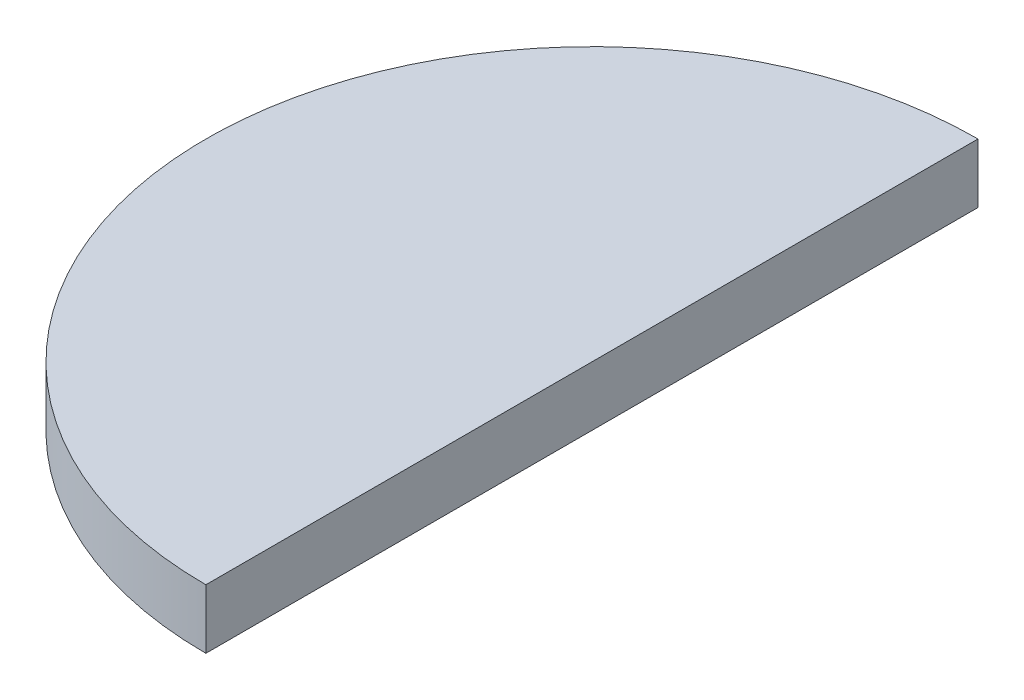
ISO-10303-21;
HEADER;
FILE_DESCRIPTION(('STEP AP214'),'2;1');
FILE_NAME('part.step','',(''),(''),'','','');
FILE_SCHEMA(('AUTOMOTIVE_DESIGN { 1 0 10303 214 1 1 1 1 }'));
ENDSEC;
DATA;
#1=APPLICATION_CONTEXT('core data for automotive mechanical design processes');
#2=APPLICATION_PROTOCOL_DEFINITION('international standard','automotive_design',2000,#1);
#3=PRODUCT_CONTEXT('',#1,'mechanical');
#4=PRODUCT('Part','Part','',(#3));
#5=PRODUCT_RELATED_PRODUCT_CATEGORY('part','',(#4));
#6=PRODUCT_DEFINITION_FORMATION('','',#4);
#7=PRODUCT_DEFINITION_CONTEXT('part definition',#1,'design');
#8=PRODUCT_DEFINITION('design','',#6,#7);
#9=PRODUCT_DEFINITION_SHAPE('','',#8);
#10=(LENGTH_UNIT() NAMED_UNIT(*) SI_UNIT(.MILLI.,.METRE.));
#11=(NAMED_UNIT(*) PLANE_ANGLE_UNIT() SI_UNIT($,.RADIAN.));
#12=(NAMED_UNIT(*) SI_UNIT($,.STERADIAN.) SOLID_ANGLE_UNIT());
#13=UNCERTAINTY_MEASURE_WITH_UNIT(LENGTH_MEASURE(1.E-05),#10,'distance_accuracy_value','');
#14=(GEOMETRIC_REPRESENTATION_CONTEXT(3) GLOBAL_UNCERTAINTY_ASSIGNED_CONTEXT((#13)) GLOBAL_UNIT_ASSIGNED_CONTEXT((#10,
#11,#12)) REPRESENTATION_CONTEXT('',''));
#15=CARTESIAN_POINT('',(0.,0.,0.));
#16=DIRECTION('',(0.,0.,1.));
#17=DIRECTION('',(1.,0.,0.));
#18=AXIS2_PLACEMENT_3D('',#15,#16,#17);
#19=CARTESIAN_POINT('',(0.,5.,32.5));
#20=DIRECTION('',(0.,-1.,0.));
#21=DIRECTION('',(0.,0.,-1.));
#22=AXIS2_PLACEMENT_3D('',#19,#20,#21);
#23=CYLINDRICAL_SURFACE('',#22,32.5);
#24=CARTESIAN_POINT('',(0.,0.,32.5));
#25=DIRECTION('',(0.,1.,0.));
#26=DIRECTION('',(0.,0.,-1.));
#27=AXIS2_PLACEMENT_3D('',#24,#25,#26);
#28=CIRCLE('',#27,32.5);
#29=CARTESIAN_POINT('',(0.,0.,0.));
#30=VERTEX_POINT('',#29);
#31=CARTESIAN_POINT('',(0.,0.,65.));
#32=VERTEX_POINT('',#31);
#33=EDGE_CURVE('E72',#30,#32,#28,.T.);
#34=ORIENTED_EDGE('',*,*,#33,.T.);
#35=DIRECTION('',(0.,-1.,0.));
#36=VECTOR('',#35,1.);
#37=CARTESIAN_POINT('',(0.,5.,65.));
#38=LINE('',#37,#36);
#39=CARTESIAN_POINT('',(0.,5.,65.));
#40=VERTEX_POINT('',#39);
#41=EDGE_CURVE('E11',#40,#32,#38,.T.);
#42=ORIENTED_EDGE('',*,*,#41,.F.);
#43=CARTESIAN_POINT('',(0.,5.,32.5));
#44=DIRECTION('',(0.,1.,0.));
#45=DIRECTION('',(0.,0.,-1.));
#46=AXIS2_PLACEMENT_3D('',#43,#44,#45);
#47=CIRCLE('',#46,32.5);
#48=CARTESIAN_POINT('',(0.,5.,0.));
#49=VERTEX_POINT('',#48);
#50=EDGE_CURVE('E71',#49,#40,#47,.T.);
#51=ORIENTED_EDGE('',*,*,#50,.F.);
#52=DIRECTION('',(0.,-1.,0.));
#53=VECTOR('',#52,1.);
#54=CARTESIAN_POINT('',(0.,5.,0.));
#55=LINE('',#54,#53);
#56=EDGE_CURVE('E48',#49,#30,#55,.T.);
#57=ORIENTED_EDGE('',*,*,#56,.T.);
#58=EDGE_LOOP('',(#34,#42,#51,#57));
#59=FACE_BOUND('',#58,.T.);
#60=ADVANCED_FACE('F39',(#59),#23,.T.);
#61=CARTESIAN_POINT('',(0.,5.,0.));
#62=DIRECTION('',(-1.,0.,0.));
#63=DIRECTION('',(0.,0.,1.));
#64=AXIS2_PLACEMENT_3D('',#61,#62,#63);
#65=PLANE('',#64);
#66=DIRECTION('',(0.,0.,-1.));
#67=VECTOR('',#66,1.);
#68=CARTESIAN_POINT('',(0.,0.,0.));
#69=LINE('',#68,#67);
#70=EDGE_CURVE('E63',#32,#30,#69,.T.);
#71=ORIENTED_EDGE('',*,*,#70,.T.);
#72=ORIENTED_EDGE('',*,*,#56,.F.);
#73=DIRECTION('',(0.,0.,-1.));
#74=VECTOR('',#73,1.);
#75=CARTESIAN_POINT('',(0.,5.,0.));
#76=LINE('',#75,#74);
#77=EDGE_CURVE('E55',#40,#49,#76,.T.);
#78=ORIENTED_EDGE('',*,*,#77,.F.);
#79=ORIENTED_EDGE('',*,*,#41,.T.);
#80=EDGE_LOOP('',(#71,#72,#78,#79));
#81=FACE_BOUND('',#80,.T.);
#82=ADVANCED_FACE('F66',(#81),#65,.F.);
#83=CARTESIAN_POINT('',(0.,5.,32.5));
#84=DIRECTION('',(0.,-1.,0.));
#85=DIRECTION('',(0.,0.,-1.));
#86=AXIS2_PLACEMENT_3D('',#83,#84,#85);
#87=PLANE('',#86);
#88=ORIENTED_EDGE('',*,*,#50,.T.);
#89=ORIENTED_EDGE('',*,*,#77,.T.);
#90=EDGE_LOOP('',(#88,#89));
#91=FACE_BOUND('',#90,.T.);
#92=ADVANCED_FACE('F83',(#91),#87,.F.);
#93=CARTESIAN_POINT('',(0.,0.,32.5));
#94=DIRECTION('',(0.,-1.,0.));
#95=DIRECTION('',(0.,0.,-1.));
#96=AXIS2_PLACEMENT_3D('',#93,#94,#95);
#97=PLANE('',#96);
#98=ORIENTED_EDGE('',*,*,#33,.F.);
#99=ORIENTED_EDGE('',*,*,#70,.F.);
#100=EDGE_LOOP('',(#98,#99));
#101=FACE_BOUND('',#100,.T.);
#102=ADVANCED_FACE('F76',(#101),#97,.T.);
#103=CLOSED_SHELL('',(#60,#82,#92,#102));
#104=MANIFOLD_SOLID_BREP('B2',#103);
#105=ADVANCED_BREP_SHAPE_REPRESENTATION('',(#18,#104),#14);
#106=SHAPE_DEFINITION_REPRESENTATION(#9,#105);
ENDSEC;
END-ISO-10303-21;
